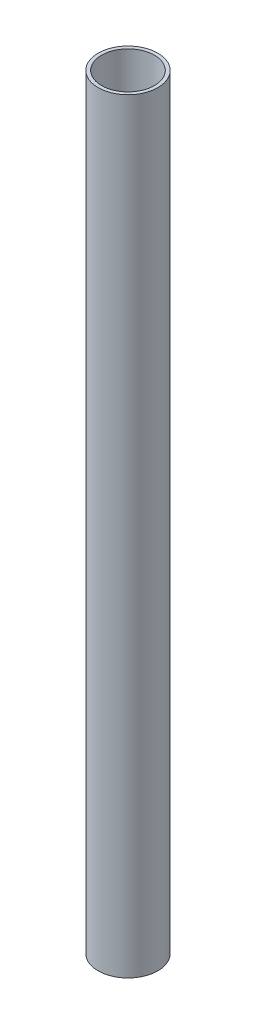
ISO-10303-21;
HEADER;
FILE_DESCRIPTION(('STEP AP214'),'2;1');
FILE_NAME('part.step','',(''),(''),'','','');
FILE_SCHEMA(('AUTOMOTIVE_DESIGN { 1 0 10303 214 1 1 1 1 }'));
ENDSEC;
DATA;
#1=APPLICATION_CONTEXT('core data for automotive mechanical design processes');
#2=APPLICATION_PROTOCOL_DEFINITION('international standard','automotive_design',2000,#1);
#3=PRODUCT_CONTEXT('',#1,'mechanical');
#4=PRODUCT('Part','Part','',(#3));
#5=PRODUCT_RELATED_PRODUCT_CATEGORY('part','',(#4));
#6=PRODUCT_DEFINITION_FORMATION('','',#4);
#7=PRODUCT_DEFINITION_CONTEXT('part definition',#1,'design');
#8=PRODUCT_DEFINITION('design','',#6,#7);
#9=PRODUCT_DEFINITION_SHAPE('','',#8);
#10=(LENGTH_UNIT() NAMED_UNIT(*) SI_UNIT(.MILLI.,.METRE.));
#11=(NAMED_UNIT(*) PLANE_ANGLE_UNIT() SI_UNIT($,.RADIAN.));
#12=(NAMED_UNIT(*) SI_UNIT($,.STERADIAN.) SOLID_ANGLE_UNIT());
#13=UNCERTAINTY_MEASURE_WITH_UNIT(LENGTH_MEASURE(1.E-05),#10,'distance_accuracy_value','');
#14=(GEOMETRIC_REPRESENTATION_CONTEXT(3) GLOBAL_UNCERTAINTY_ASSIGNED_CONTEXT((#13)) GLOBAL_UNIT_ASSIGNED_CONTEXT((#10,
#11,#12)) REPRESENTATION_CONTEXT('',''));
#15=CARTESIAN_POINT('',(0.,0.,0.));
#16=DIRECTION('',(0.,0.,1.));
#17=DIRECTION('',(1.,0.,0.));
#18=AXIS2_PLACEMENT_3D('',#15,#16,#17);
#19=CARTESIAN_POINT('',(0.,333.,0.));
#20=DIRECTION('',(0.,1.,0.));
#21=DIRECTION('',(0.,0.,1.));
#22=AXIS2_PLACEMENT_3D('',#19,#20,#21);
#23=PLANE('',#22);
#24=CARTESIAN_POINT('',(0.,333.,0.));
#25=DIRECTION('',(0.,1.,0.));
#26=DIRECTION('',(0.,0.,1.));
#27=AXIS2_PLACEMENT_3D('',#24,#25,#26);
#28=CIRCLE('',#27,13.);
#29=CARTESIAN_POINT('',(0.,333.,13.));
#30=VERTEX_POINT('',#29);
#31=EDGE_CURVE('E10',#30,#30,#28,.T.);
#32=ORIENTED_EDGE('',*,*,#31,.T.);
#33=EDGE_LOOP('',(#32));
#34=FACE_BOUND('',#33,.T.);
#35=CARTESIAN_POINT('',(0.,333.,0.));
#36=DIRECTION('',(0.,1.,0.));
#37=DIRECTION('',(0.,0.,1.));
#38=AXIS2_PLACEMENT_3D('',#35,#36,#37);
#39=CIRCLE('',#38,11.5);
#40=CARTESIAN_POINT('',(0.,333.,11.5));
#41=VERTEX_POINT('',#40);
#42=EDGE_CURVE('E44',#41,#41,#39,.T.);
#43=ORIENTED_EDGE('',*,*,#42,.F.);
#44=EDGE_LOOP('',(#43));
#45=FACE_BOUND('',#44,.T.);
#46=ADVANCED_FACE('F33',(#34,#45),#23,.T.);
#47=CARTESIAN_POINT('',(0.,0.,0.));
#48=DIRECTION('',(0.,1.,0.));
#49=DIRECTION('',(0.,0.,1.));
#50=AXIS2_PLACEMENT_3D('',#47,#48,#49);
#51=PLANE('',#50);
#52=CARTESIAN_POINT('',(0.,0.,0.));
#53=DIRECTION('',(0.,1.,0.));
#54=DIRECTION('',(0.,0.,1.));
#55=AXIS2_PLACEMENT_3D('',#52,#53,#54);
#56=CIRCLE('',#55,13.);
#57=CARTESIAN_POINT('',(0.,0.,13.));
#58=VERTEX_POINT('',#57);
#59=EDGE_CURVE('E37',#58,#58,#56,.T.);
#60=ORIENTED_EDGE('',*,*,#59,.F.);
#61=EDGE_LOOP('',(#60));
#62=FACE_BOUND('',#61,.T.);
#63=CARTESIAN_POINT('',(0.,0.,0.));
#64=DIRECTION('',(0.,1.,0.));
#65=DIRECTION('',(0.,0.,1.));
#66=AXIS2_PLACEMENT_3D('',#63,#64,#65);
#67=CIRCLE('',#66,11.5);
#68=CARTESIAN_POINT('',(0.,0.,11.5));
#69=VERTEX_POINT('',#68);
#70=EDGE_CURVE('E46',#69,#69,#67,.T.);
#71=ORIENTED_EDGE('',*,*,#70,.T.);
#72=EDGE_LOOP('',(#71));
#73=FACE_BOUND('',#72,.T.);
#74=ADVANCED_FACE('F56',(#62,#73),#51,.F.);
#75=CARTESIAN_POINT('',(0.,333.,0.));
#76=DIRECTION('',(0.,-1.,0.));
#77=DIRECTION('',(0.,0.,-1.));
#78=AXIS2_PLACEMENT_3D('',#75,#76,#77);
#79=CYLINDRICAL_SURFACE('',#78,13.);
#80=ORIENTED_EDGE('',*,*,#31,.F.);
#81=EDGE_LOOP('',(#80));
#82=FACE_BOUND('',#81,.T.);
#83=ORIENTED_EDGE('',*,*,#59,.T.);
#84=EDGE_LOOP('',(#83));
#85=FACE_BOUND('',#84,.T.);
#86=ADVANCED_FACE('F35',(#82,#85),#79,.T.);
#87=CARTESIAN_POINT('',(0.,333.,0.));
#88=DIRECTION('',(0.,-1.,0.));
#89=DIRECTION('',(0.,0.,-1.));
#90=AXIS2_PLACEMENT_3D('',#87,#88,#89);
#91=CYLINDRICAL_SURFACE('',#90,11.5);
#92=ORIENTED_EDGE('',*,*,#42,.T.);
#93=EDGE_LOOP('',(#92));
#94=FACE_BOUND('',#93,.T.);
#95=ORIENTED_EDGE('',*,*,#70,.F.);
#96=EDGE_LOOP('',(#95));
#97=FACE_BOUND('',#96,.T.);
#98=ADVANCED_FACE('F52',(#94,#97),#91,.F.);
#99=CLOSED_SHELL('',(#46,#74,#86,#98));
#100=MANIFOLD_SOLID_BREP('B2',#99);
#101=ADVANCED_BREP_SHAPE_REPRESENTATION('',(#18,#100),#14);
#102=SHAPE_DEFINITION_REPRESENTATION(#9,#101);
ENDSEC;
END-ISO-10303-21;
